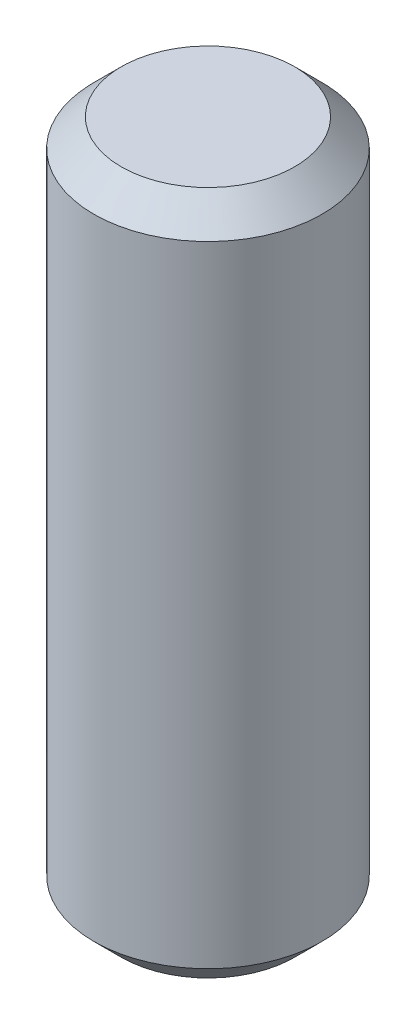
ISO-10303-21;
HEADER;
FILE_DESCRIPTION(('STEP AP214'),'2;1');
FILE_NAME('part.step','',(''),(''),'','','');
FILE_SCHEMA(('AUTOMOTIVE_DESIGN { 1 0 10303 214 1 1 1 1 }'));
ENDSEC;
DATA;
#1=APPLICATION_CONTEXT('core data for automotive mechanical design processes');
#2=APPLICATION_PROTOCOL_DEFINITION('international standard','automotive_design',2000,#1);
#3=PRODUCT_CONTEXT('',#1,'mechanical');
#4=PRODUCT('Part','Part','',(#3));
#5=PRODUCT_RELATED_PRODUCT_CATEGORY('part','',(#4));
#6=PRODUCT_DEFINITION_FORMATION('','',#4);
#7=PRODUCT_DEFINITION_CONTEXT('part definition',#1,'design');
#8=PRODUCT_DEFINITION('design','',#6,#7);
#9=PRODUCT_DEFINITION_SHAPE('','',#8);
#10=(LENGTH_UNIT() NAMED_UNIT(*) SI_UNIT(.MILLI.,.METRE.));
#11=(NAMED_UNIT(*) PLANE_ANGLE_UNIT() SI_UNIT($,.RADIAN.));
#12=(NAMED_UNIT(*) SI_UNIT($,.STERADIAN.) SOLID_ANGLE_UNIT());
#13=UNCERTAINTY_MEASURE_WITH_UNIT(LENGTH_MEASURE(1.E-05),#10,'distance_accuracy_value','');
#14=(GEOMETRIC_REPRESENTATION_CONTEXT(3) GLOBAL_UNCERTAINTY_ASSIGNED_CONTEXT((#13)) GLOBAL_UNIT_ASSIGNED_CONTEXT((#10,
#11,#12)) REPRESENTATION_CONTEXT('',''));
#15=CARTESIAN_POINT('',(0.,0.,0.));
#16=DIRECTION('',(0.,0.,1.));
#17=DIRECTION('',(1.,0.,0.));
#18=AXIS2_PLACEMENT_3D('',#15,#16,#17);
#19=CARTESIAN_POINT('',(0.,19.05,0.));
#20=DIRECTION('',(0.,-1.,0.));
#21=DIRECTION('',(0.,0.,-1.));
#22=AXIS2_PLACEMENT_3D('',#19,#20,#21);
#23=CYLINDRICAL_SURFACE('',#22,6.35);
#24=CARTESIAN_POINT('',(0.,-17.526,0.));
#25=DIRECTION('',(0.,1.,0.));
#26=DIRECTION('',(0.,0.,1.));
#27=AXIS2_PLACEMENT_3D('',#24,#25,#26);
#28=CIRCLE('',#27,6.35);
#29=CARTESIAN_POINT('',(0.,-17.526,6.35));
#30=VERTEX_POINT('',#29);
#31=EDGE_CURVE('E43',#30,#30,#28,.T.);
#32=ORIENTED_EDGE('',*,*,#31,.T.);
#33=EDGE_LOOP('',(#32));
#34=FACE_BOUND('',#33,.T.);
#35=CARTESIAN_POINT('',(0.,17.526,0.));
#36=DIRECTION('',(0.,1.,0.));
#37=DIRECTION('',(0.,0.,1.));
#38=AXIS2_PLACEMENT_3D('',#35,#36,#37);
#39=CIRCLE('',#38,6.35);
#40=CARTESIAN_POINT('',(0.,17.526,6.35));
#41=VERTEX_POINT('',#40);
#42=EDGE_CURVE('E47',#41,#41,#39,.F.);
#43=ORIENTED_EDGE('',*,*,#42,.T.);
#44=EDGE_LOOP('',(#43));
#45=FACE_BOUND('',#44,.T.);
#46=ADVANCED_FACE('F32',(#34,#45),#23,.T.);
#47=CARTESIAN_POINT('',(0.,19.05,0.));
#48=DIRECTION('',(0.,1.,0.));
#49=DIRECTION('',(0.,0.,1.));
#50=AXIS2_PLACEMENT_3D('',#47,#48,#49);
#51=PLANE('',#50);
#52=CARTESIAN_POINT('',(0.,19.05,0.));
#53=DIRECTION('',(0.,1.,0.));
#54=DIRECTION('',(0.,0.,1.));
#55=AXIS2_PLACEMENT_3D('',#52,#53,#54);
#56=CIRCLE('',#55,4.82600000000002);
#57=CARTESIAN_POINT('',(0.,19.05,4.82600000000002));
#58=VERTEX_POINT('',#57);
#59=EDGE_CURVE('E10',#58,#58,#56,.T.);
#60=ORIENTED_EDGE('',*,*,#59,.T.);
#61=EDGE_LOOP('',(#60));
#62=FACE_BOUND('',#61,.T.);
#63=ADVANCED_FACE('F63',(#62),#51,.T.);
#64=CARTESIAN_POINT('',(0.,-19.05,0.));
#65=DIRECTION('',(0.,1.,0.));
#66=DIRECTION('',(0.,0.,1.));
#67=AXIS2_PLACEMENT_3D('',#64,#65,#66);
#68=PLANE('',#67);
#69=CARTESIAN_POINT('',(0.,-19.05,0.));
#70=DIRECTION('',(0.,1.,0.));
#71=DIRECTION('',(0.,0.,1.));
#72=AXIS2_PLACEMENT_3D('',#69,#70,#71);
#73=CIRCLE('',#72,4.82599999999996);
#74=CARTESIAN_POINT('',(0.,-19.05,4.82599999999996));
#75=VERTEX_POINT('',#74);
#76=EDGE_CURVE('E39',#75,#75,#73,.F.);
#77=ORIENTED_EDGE('',*,*,#76,.T.);
#78=EDGE_LOOP('',(#77));
#79=FACE_BOUND('',#78,.T.);
#80=ADVANCED_FACE('F60',(#79),#68,.F.);
#81=CARTESIAN_POINT('',(0.,-17.526,0.));
#82=DIRECTION('',(0.,1.,0.));
#83=DIRECTION('',(0.,0.,1.));
#84=AXIS2_PLACEMENT_3D('',#81,#82,#83);
#85=CONICAL_SURFACE('',#84,6.35,0.78539816339745);
#86=ORIENTED_EDGE('',*,*,#76,.F.);
#87=EDGE_LOOP('',(#86));
#88=FACE_BOUND('',#87,.T.);
#89=ORIENTED_EDGE('',*,*,#31,.F.);
#90=EDGE_LOOP('',(#89));
#91=FACE_BOUND('',#90,.T.);
#92=ADVANCED_FACE('F56',(#88,#91),#85,.T.);
#93=CARTESIAN_POINT('',(0.,19.05,0.));
#94=DIRECTION('',(0.,-1.,0.));
#95=DIRECTION('',(0.,0.,-1.));
#96=AXIS2_PLACEMENT_3D('',#93,#94,#95);
#97=CONICAL_SURFACE('',#96,4.82600000000002,0.785398163397446);
#98=ORIENTED_EDGE('',*,*,#42,.F.);
#99=EDGE_LOOP('',(#98));
#100=FACE_BOUND('',#99,.T.);
#101=ORIENTED_EDGE('',*,*,#59,.F.);
#102=EDGE_LOOP('',(#101));
#103=FACE_BOUND('',#102,.T.);
#104=ADVANCED_FACE('F34',(#100,#103),#97,.T.);
#105=CLOSED_SHELL('',(#46,#63,#80,#92,#104));
#106=MANIFOLD_SOLID_BREP('B2',#105);
#107=ADVANCED_BREP_SHAPE_REPRESENTATION('',(#18,#106),#14);
#108=SHAPE_DEFINITION_REPRESENTATION(#9,#107);
ENDSEC;
END-ISO-10303-21;
